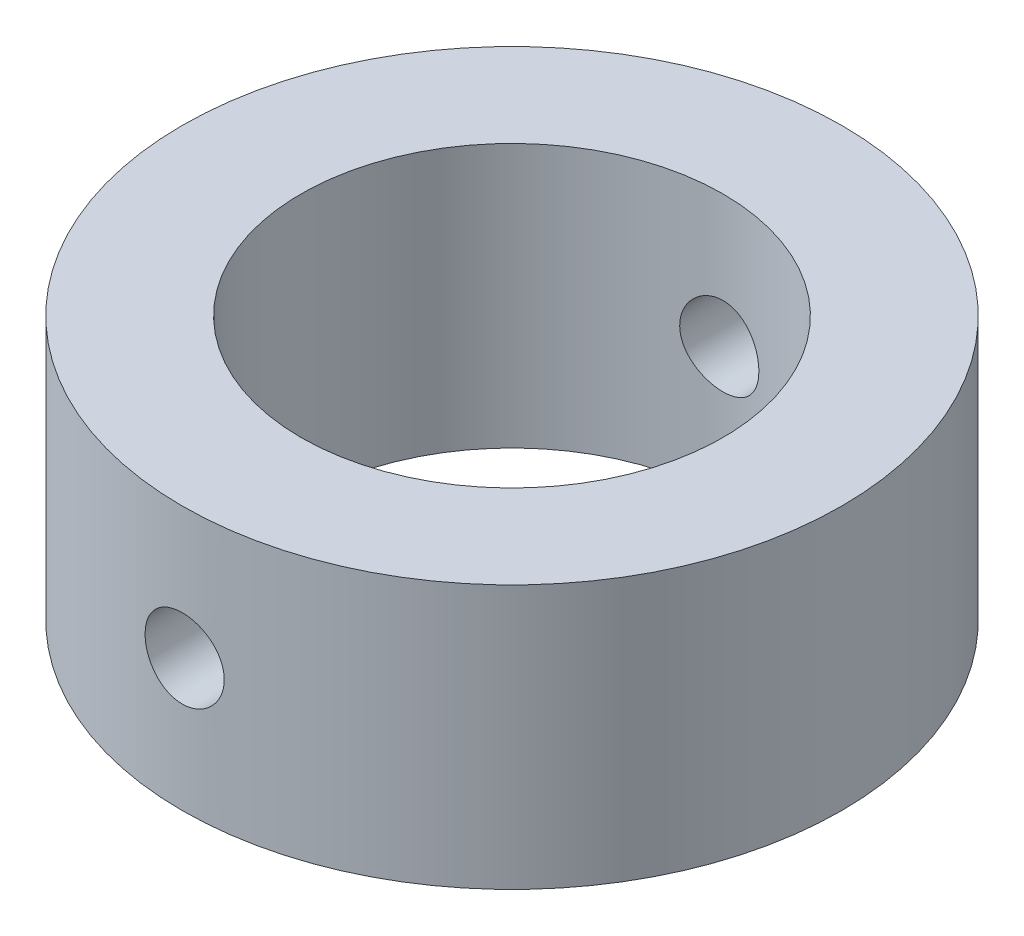
ISO-10303-21;
HEADER;
FILE_DESCRIPTION(('STEP AP214'),'2;1');
FILE_NAME('part.step','',(''),(''),'','','');
FILE_SCHEMA(('AUTOMOTIVE_DESIGN { 1 0 10303 214 1 1 1 1 }'));
ENDSEC;
DATA;
#1=APPLICATION_CONTEXT('core data for automotive mechanical design processes');
#2=APPLICATION_PROTOCOL_DEFINITION('international standard','automotive_design',2000,#1);
#3=PRODUCT_CONTEXT('',#1,'mechanical');
#4=PRODUCT('Part','Part','',(#3));
#5=PRODUCT_RELATED_PRODUCT_CATEGORY('part','',(#4));
#6=PRODUCT_DEFINITION_FORMATION('','',#4);
#7=PRODUCT_DEFINITION_CONTEXT('part definition',#1,'design');
#8=PRODUCT_DEFINITION('design','',#6,#7);
#9=PRODUCT_DEFINITION_SHAPE('','',#8);
#10=(LENGTH_UNIT() NAMED_UNIT(*) SI_UNIT(.MILLI.,.METRE.));
#11=(NAMED_UNIT(*) PLANE_ANGLE_UNIT() SI_UNIT($,.RADIAN.));
#12=(NAMED_UNIT(*) SI_UNIT($,.STERADIAN.) SOLID_ANGLE_UNIT());
#13=UNCERTAINTY_MEASURE_WITH_UNIT(LENGTH_MEASURE(1.E-05),#10,'distance_accuracy_value','');
#14=(GEOMETRIC_REPRESENTATION_CONTEXT(3) GLOBAL_UNCERTAINTY_ASSIGNED_CONTEXT((#13)) GLOBAL_UNIT_ASSIGNED_CONTEXT((#10,
#11,#12)) REPRESENTATION_CONTEXT('',''));
#15=CARTESIAN_POINT('',(0.,0.,0.));
#16=DIRECTION('',(0.,0.,1.));
#17=DIRECTION('',(1.,0.,0.));
#18=AXIS2_PLACEMENT_3D('',#15,#16,#17);
#19=CARTESIAN_POINT('',(7.36079797899167E-07,15.0000028942025,2.4856637945483E-06));
#20=DIRECTION('',(0.,-1.,0.));
#21=DIRECTION('',(0.,0.,-1.));
#22=AXIS2_PLACEMENT_3D('',#19,#20,#21);
#23=CYLINDRICAL_SURFACE('',#22,25.);
#24=CARTESIAN_POINT('',(7.36079797899167E-07,8.00000289420247,-24.9999975143362));
#25=CARTESIAN_POINT('',(-0.167863311027902,7.99999573026103,-24.9999952500821));
#26=CARTESIAN_POINT('',(-0.335833581251394,7.98586623550978,-24.998288934377));
#27=CARTESIAN_POINT('',(-0.667103835228452,7.92972183004708,-24.9916462197582));
#28=CARTESIAN_POINT('',(-0.830398693510271,7.88767745295188,-24.986706407709));
#29=CARTESIAN_POINT('',(-1.14747405926073,7.77695661767645,-24.9741534408788));
#30=CARTESIAN_POINT('',(-1.30126075151245,7.70829768737829,-24.9665420458671));
#31=CARTESIAN_POINT('',(-1.5950984217522,7.54633415911917,-24.9494934407707));
#32=CARTESIAN_POINT('',(-1.73515183105536,7.45303393444915,-24.9400565547503));
#33=CARTESIAN_POINT('',(-1.99829057926471,7.24392803222722,-24.9203576197782));
#34=CARTESIAN_POINT('',(-2.1212959552274,7.12802205409055,-24.9100920174266));
#35=CARTESIAN_POINT('',(-2.34615857430362,6.87720992931457,-24.8899214540514));
#36=CARTESIAN_POINT('',(-2.44801476218494,6.74230283518382,-24.880016511043));
#37=CARTESIAN_POINT('',(-2.62798269265916,6.45680206890408,-24.8616535513767));
#38=CARTESIAN_POINT('',(-2.7060200206459,6.30616116962233,-24.8532001047333));
#39=CARTESIAN_POINT('',(-2.8356598369358,5.99379419209372,-24.8387436488048));
#40=CARTESIAN_POINT('',(-2.88726325088797,5.83206850223316,-24.832740553716));
#41=CARTESIAN_POINT('',(-2.9623285643742,5.50295003489104,-24.8238981217099));
#42=CARTESIAN_POINT('',(-2.98592504379666,5.33558836577479,-24.8210436595905));
#43=CARTESIAN_POINT('',(-3.0047230161169,4.9992579578383,-24.8187752833973));
#44=CARTESIAN_POINT('',(-2.99992556444868,4.8302892789855,-24.8193612414395));
#45=CARTESIAN_POINT('',(-2.96218242470688,4.49647692941812,-24.8238936609668));
#46=CARTESIAN_POINT('',(-2.92938469614323,4.33161625552229,-24.8278224578037));
#47=CARTESIAN_POINT('',(-2.83680272562087,4.0097558663811,-24.838570323097));
#48=CARTESIAN_POINT('',(-2.77701797617835,3.85275629902347,-24.845389445905));
#49=CARTESIAN_POINT('',(-2.63199907091882,3.55061342596335,-24.8611697222838));
#50=CARTESIAN_POINT('',(-2.54670032595945,3.40550141584891,-24.870136300556));
#51=CARTESIAN_POINT('',(-2.3531209956149,3.1315956832867,-24.8891969131263));
#52=CARTESIAN_POINT('',(-2.24483944115177,3.00280264929989,-24.8992909949575));
#53=CARTESIAN_POINT('',(-2.007546819542,2.76433180983808,-24.9195478451999));
#54=CARTESIAN_POINT('',(-1.87840816443236,2.65478092434541,-24.9297106417602));
#55=CARTESIAN_POINT('',(-1.60350722285892,2.45889137320216,-24.9488995941911));
#56=CARTESIAN_POINT('',(-1.45774490300025,2.37255275418332,-24.9579257477783));
#57=CARTESIAN_POINT('',(-1.15363857218305,2.22553960856281,-24.9738294005064));
#58=CARTESIAN_POINT('',(-0.995290842635794,2.16487270087203,-24.9807062616171));
#59=CARTESIAN_POINT('',(-0.670555286193642,2.07102415635156,-24.9915305796452));
#60=CARTESIAN_POINT('',(-0.504167806361826,2.03784133419799,-24.9954781628946));
#61=CARTESIAN_POINT('',(-0.169173660294419,2.00006663870478,-24.9999827643666));
#62=CARTESIAN_POINT('',(-0.000586984352253934,1.99529986180177,-25.0005605237115));
#63=CARTESIAN_POINT('',(0.334982804323058,2.01403147207073,-24.9983162966593));
#64=CARTESIAN_POINT('',(0.501965948407126,2.03752930549782,-24.995494376867));
#65=CARTESIAN_POINT('',(0.829075000008153,2.11197785820556,-24.9867808524048));
#66=CARTESIAN_POINT('',(0.989220082448832,2.16284550725255,-24.9808985381271));
#67=CARTESIAN_POINT('',(1.29870613376626,2.29050359755605,-24.9667230645154));
#68=CARTESIAN_POINT('',(1.44804676200327,2.36729485569255,-24.9584298292121));
#69=CARTESIAN_POINT('',(1.73246791374484,2.54504581010489,-24.9403060302057));
#70=CARTESIAN_POINT('',(1.86747702570731,2.64611903201328,-24.9304683228005));
#71=CARTESIAN_POINT('',(2.11867698760183,2.86940374061064,-24.9103793062781));
#72=CARTESIAN_POINT('',(2.23486715080929,2.99161599835042,-24.9001279820846));
#73=CARTESIAN_POINT('',(2.44574868834133,3.25447850963015,-24.8803034628304));
#74=CARTESIAN_POINT('',(2.54032436839919,3.39522190954632,-24.8707340974669));
#75=CARTESIAN_POINT('',(2.70449388037312,3.69069791927802,-24.8534190136745));
#76=CARTESIAN_POINT('',(2.77408817964054,3.84543026732071,-24.8456732611305));
#77=CARTESIAN_POINT('',(2.88613070276138,4.16411350309716,-24.8329080877864));
#78=CARTESIAN_POINT('',(2.92864493767326,4.32804090606186,-24.8278820418995));
#79=CARTESIAN_POINT('',(2.98553345771496,4.66077186368753,-24.8211060417949));
#80=CARTESIAN_POINT('',(2.99990894134061,4.82957521035979,-24.8193559480468));
#81=CARTESIAN_POINT('',(3.00009107425911,5.16611562383964,-24.8193338409432));
#82=CARTESIAN_POINT('',(2.98607947279331,5.33385261997373,-24.8210397007305));
#83=CARTESIAN_POINT('',(2.93026922280069,5.66456968059663,-24.8276898090787));
#84=CARTESIAN_POINT('',(2.88847056430047,5.82754974337805,-24.8326340588019));
#85=CARTESIAN_POINT('',(2.77832813428525,6.14410743309116,-24.8451971667948));
#86=CARTESIAN_POINT('',(2.70999239178519,6.29768788769795,-24.8528152160174));
#87=CARTESIAN_POINT('',(2.54873356235989,6.59123064127257,-24.8698689682501));
#88=CARTESIAN_POINT('',(2.45581026317425,6.73119282266177,-24.8793046869515));
#89=CARTESIAN_POINT('',(2.24733763255185,6.9944558343113,-24.899003026595));
#90=CARTESIAN_POINT('',(2.1316527753813,7.11764899746874,-24.9092703724709));
#91=CARTESIAN_POINT('',(1.88122166942427,7.34294537376847,-24.9294330111531));
#92=CARTESIAN_POINT('',(1.74647091871581,7.44504359183166,-24.9393282153872));
#93=CARTESIAN_POINT('',(1.46119396073117,7.62555347220133,-24.9576696852686));
#94=CARTESIAN_POINT('',(1.31061397070397,7.70388061992475,-24.9661107359572));
#95=CARTESIAN_POINT('',(0.998423487765109,7.83402665864504,-24.9805393663089));
#96=CARTESIAN_POINT('',(0.836825300441942,7.88587459038285,-24.9865296323977));
#97=CARTESIAN_POINT('',(0.561977837316495,7.94906631454059,-24.9939243469361));
#98=CARTESIAN_POINT('',(0.450467305833285,7.96814037808884,-24.9961907937692));
#99=CARTESIAN_POINT('',(0.225987471773493,7.99361103769343,-24.9992281347566));
#100=CARTESIAN_POINT('',(0.113018178833423,8.00000771745292,-24.9999990387854));
#101=CARTESIAN_POINT('',(7.36079797899167E-07,8.00000289420247,-24.9999975143362));
#102=B_SPLINE_CURVE_WITH_KNOTS('',3,(#24,#25,#26,#27,#28,#29,#30,#31,#32,#33,#34,#35,#36,#37,
#38,#39,#40,#41,#42,#43,#44,#45,#46,#47,#48,#49,#50,#51,#52,#53,#54,#55,#56,#57,#58,#59,#60,#61,
#62,#63,#64,#65,#66,#67,#68,#69,#70,#71,#72,#73,#74,#75,#76,#77,#78,#79,#80,#81,#82,#83,#84,#85,
#86,#87,#88,#89,#90,#91,#92,#93,#94,#95,#96,#97,#98,#99,#100,#101),.UNSPECIFIED.,.T.,.F.,(4,2,2,
2,2,2,2,2,2,2,2,2,2,2,2,2,2,2,2,2,2,2,2,2,2,2,2,2,2,2,2,2,2,2,2,2,2,2,4),(0.,0.50317935095616,
1.00689069408623,1.5102708637556,2.01356175441693,2.51913872195878,3.02474090904884,
3.53190689496397,4.03905511999113,4.54375638343279,5.0484388866848,5.55047092912253,
6.05251241253396,6.55583573710536,7.05918028869262,7.56572944640317,8.07227962172601,
8.57898002694278,9.08565857822619,9.58921522624226,10.0927620090108,10.5947890255775,
11.0968318630167,11.6012692178556,12.1057249760356,12.6128207581672,13.119907053063,
13.6257524826489,14.1315763666154,14.6341719319229,15.1367676776234,15.6392114771388,
16.1416596143121,16.6471952402032,17.1528504352009,17.6602829023946,18.1671576479275,
18.5059342945627,18.8447087043981),.UNSPECIFIED.);
#103=CARTESIAN_POINT('',(7.36079797899167E-07,8.00000289420247,-24.9999975143362));
#104=VERTEX_POINT('',#103);
#105=EDGE_CURVE('E93',#104,#104,#102,.T.);
#106=ORIENTED_EDGE('',*,*,#105,.T.);
#107=EDGE_LOOP('',(#106));
#108=FACE_BOUND('',#107,.T.);
#109=CARTESIAN_POINT('',(3.0000007360798,5.00000289420247,24.8193497776455));
#110=CARTESIAN_POINT('',(2.99999356780694,4.8321437530026,24.8193521032158));
#111=CARTESIAN_POINT('',(2.98586487103804,4.66417837405262,24.821071063127));
#112=CARTESIAN_POINT('',(2.92972392317105,4.33291828214459,24.8277589352753));
#113=CARTESIAN_POINT('',(2.88768218846944,4.16962869851621,24.8327312838769));
#114=CARTESIAN_POINT('',(2.7769690822401,3.85256448869794,24.8453547965709));
#115=CARTESIAN_POINT('',(2.7083153639778,3.69878363306874,24.8530041845025));
#116=CARTESIAN_POINT('',(2.5463641116587,3.40495575209901,24.8701177355299));
#117=CARTESIAN_POINT('',(2.4530709381998,3.26490630263383,24.8795815774294));
#118=CARTESIAN_POINT('',(2.24397217538033,3.00176312259296,24.8993124911563));
#119=CARTESIAN_POINT('',(2.1280647085863,2.87875059985404,24.909583067322));
#120=CARTESIAN_POINT('',(1.87724660042855,2.65387417604038,24.9297386442021));
#121=CARTESIAN_POINT('',(1.74233503113392,2.55201130826062,24.9396236260586));
#122=CARTESIAN_POINT('',(1.45683030454778,2.37203636126624,24.9579298879719));
#123=CARTESIAN_POINT('',(1.30619068992879,2.29399747846284,24.9663466237309));
#124=CARTESIAN_POINT('',(0.993826503352572,2.16435443381772,24.9807296099874));
#125=CARTESIAN_POINT('',(0.832102312165339,2.11274936445473,24.9866959446103));
#126=CARTESIAN_POINT('',(0.502988593064881,2.03768063809902,24.9954812181165));
#127=CARTESIAN_POINT('',(0.335630207123177,2.0140822407567,24.9983152221046));
#128=CARTESIAN_POINT('',(-0.000693760588767737,1.99527929489195,25.0005679222739));
#129=CARTESIAN_POINT('',(-0.169659283588542,2.00007371204424,24.9999867428672));
#130=CARTESIAN_POINT('',(-0.503484931437732,2.03781201605383,24.9954867781904));
#131=CARTESIAN_POINT('',(-0.668361701488416,2.07061099917486,24.9915851740976));
#132=CARTESIAN_POINT('',(-0.99025363401138,2.16320104591846,24.9809021279019));
#133=CARTESIAN_POINT('',(-1.14726865696281,2.22299258838411,24.9741206347104));
#134=CARTESIAN_POINT('',(-1.44943038717958,2.36802562310899,24.9584102761191));
#135=CARTESIAN_POINT('',(-1.59454656119559,2.45333013020889,24.949476104533));
#136=CARTESIAN_POINT('',(-1.86845818411899,2.64692179315862,24.9304605823799));
#137=CARTESIAN_POINT('',(-1.99725294268709,2.75520992061808,24.9203791833234));
#138=CARTESIAN_POINT('',(-2.2357164751507,2.99250724374293,24.9001231601934));
#139=CARTESIAN_POINT('',(-2.34525965270399,3.12164267557596,24.889948348918));
#140=CARTESIAN_POINT('',(-2.54113518217177,3.39653440788197,24.8707150902712));
#141=CARTESIAN_POINT('',(-2.62746747122546,3.54229075336695,24.8616566459233));
#142=CARTESIAN_POINT('',(-2.7744760475067,3.84639538434985,24.8456816911853));
#143=CARTESIAN_POINT('',(-2.83514277549662,4.00474833546038,24.8387659791205));
#144=CARTESIAN_POINT('',(-2.92898936424398,4.32949525370365,24.8278753163249));
#145=CARTESIAN_POINT('',(-2.96217044250571,4.49588886432177,24.8239002353369));
#146=CARTESIAN_POINT('',(-2.99993855104186,4.83088599057916,24.8193644872275));
#147=CARTESIAN_POINT('',(-3.00470210662792,4.9994693300836,24.8187827417272));
#148=CARTESIAN_POINT('',(-2.98596524447623,5.3350316750454,24.8210438157784));
#149=CARTESIAN_POINT('',(-2.96246538083269,5.50201071188985,24.8238865681938));
#150=CARTESIAN_POINT('',(-2.88801718334038,5.82909867780044,24.8326571131616));
#151=CARTESIAN_POINT('',(-2.83715388890958,5.98922724101179,24.8385753458796));
#152=CARTESIAN_POINT('',(-2.70951003184644,6.29868217717843,24.8528222709886));
#153=CARTESIAN_POINT('',(-2.63272862650632,6.44800819870551,24.8611510417552));
#154=CARTESIAN_POINT('',(-2.45499229113631,6.73241918917709,24.8793312169937));
#155=CARTESIAN_POINT('',(-2.35392133533496,6.86743118108377,24.8891898466493));
#156=CARTESIAN_POINT('',(-2.13063944228727,7.11863800721426,24.9092960397007));
#157=CARTESIAN_POINT('',(-2.00842774835641,7.23483216760835,24.9195436170076));
#158=CARTESIAN_POINT('',(-1.74556353658792,7.44572264143739,24.9393375801548));
#159=CARTESIAN_POINT('',(-1.60481776333804,7.54030314071389,24.9488800112668));
#160=CARTESIAN_POINT('',(-1.30933569333078,7.70448110353156,24.9661297287798));
#161=CARTESIAN_POINT('',(-1.15459965956462,7.77407903657691,24.9738370496676));
#162=CARTESIAN_POINT('',(-0.835918508640188,7.88612389907826,24.9865305287152));
#163=CARTESIAN_POINT('',(-0.671997434567384,7.92863841408672,24.9915234559266));
#164=CARTESIAN_POINT('',(-0.339279848911679,7.98552963778462,24.9982536221145));
#165=CARTESIAN_POINT('',(-0.17048353938146,7.9999075108956,24.9999909958205));
#166=CARTESIAN_POINT('',(0.166060742335456,8.00009673831479,25.0000137905284));
#167=CARTESIAN_POINT('',(0.333808640738662,7.9860869308857,24.9983208221882));
#168=CARTESIAN_POINT('',(0.664547960876042,7.93027643929997,24.9917160258713));
#169=CARTESIAN_POINT('',(0.827539384169318,7.88847576425288,24.9868041989497));
#170=CARTESIAN_POINT('',(1.14412029206338,7.77832487907095,24.9743112876111));
#171=CARTESIAN_POINT('',(1.29771254482768,7.70998252974823,24.9667309935726));
#172=CARTESIAN_POINT('',(1.59127614660523,7.5487068246178,24.9497417299861));
#173=CARTESIAN_POINT('',(1.73124738537395,7.45577326979864,24.9403327456391));
#174=CARTESIAN_POINT('',(1.99451022032793,7.24728921219718,24.9206664218668));
#175=CARTESIAN_POINT('',(2.11769600395492,7.13160553888034,24.9104043031858));
#176=CARTESIAN_POINT('',(2.34297804320556,6.8811798570464,24.8902271722101));
#177=CARTESIAN_POINT('',(2.44506928421694,6.74643332968758,24.8803122429138));
#178=CARTESIAN_POINT('',(2.62557148336232,6.46115995804344,24.8619144060897));
#179=CARTESIAN_POINT('',(2.70389671806172,6.31057856597588,24.853436730083));
#180=CARTESIAN_POINT('',(2.8340387942962,5.99838514049842,24.8389347221651));
#181=CARTESIAN_POINT('',(2.88588470033532,5.83678542301693,24.8329077018291));
#182=CARTESIAN_POINT('',(2.94907083681895,5.56194335509088,24.825465209517));
#183=CARTESIAN_POINT('',(2.96814238549985,5.4504401422402,24.8231832166501));
#184=CARTESIAN_POINT('',(2.99360970517433,5.2259749620706,24.8201247229781));
#185=CARTESIAN_POINT('',(3.00000556207439,5.1130130046432,24.8193482119699));
#186=CARTESIAN_POINT('',(3.0000007360798,5.00000289420247,24.8193497776455));
#187=B_SPLINE_CURVE_WITH_KNOTS('',3,(#109,#110,#111,#112,#113,#114,#115,#116,#117,#118,#119,
#120,#121,#122,#123,#124,#125,#126,#127,#128,#129,#130,#131,#132,#133,#134,#135,#136,#137,#138,
#139,#140,#141,#142,#143,#144,#145,#146,#147,#148,#149,#150,#151,#152,#153,#154,#155,#156,#157,
#158,#159,#160,#161,#162,#163,#164,#165,#166,#167,#168,#169,#170,#171,#172,#173,#174,#175,#176,
#177,#178,#179,#180,#181,#182,#183,#184,#185,#186),.UNSPECIFIED.,.T.,.F.,(4,2,2,2,2,2,2,2,2,2,2,
2,2,2,2,2,2,2,2,2,2,2,2,2,2,2,2,2,2,2,2,2,2,2,2,2,2,2,4),(0.,0.503164613232924,1.00686154966524,
1.51022492507114,2.01349927674882,2.51909553323416,3.02471648549883,3.53187561756201,
4.03901733675556,4.54370917218766,5.04838262225285,5.5504604616135,6.05254720809333,
6.55588445357933,7.05924298138499,7.56577244411506,8.0723032786378,8.5790226067925,
9.08571948810825,9.58926554088958,10.0928017219916,10.5947819896887,11.0967785804672,
11.6012225031328,12.105684484956,12.6127892929794,13.119884570345,13.6257094034364,
14.1315133027652,14.6341406188081,15.1367677700954,15.6392461723566,16.1417286411941,
16.6472450412647,17.1528814752089,17.6603206216507,18.1672015841626,18.5059562893408,
18.8447086986815),.UNSPECIFIED.);
#188=CARTESIAN_POINT('',(3.0000007360798,5.00000289420247,24.8193497776455));
#189=VERTEX_POINT('',#188);
#190=EDGE_CURVE('E88',#189,#189,#187,.T.);
#191=ORIENTED_EDGE('',*,*,#190,.T.);
#192=EDGE_LOOP('',(#191));
#193=FACE_BOUND('',#192,.T.);
#194=CARTESIAN_POINT('',(7.36079797899167E-07,15.0000028942025,2.4856637945483E-06));
#195=DIRECTION('',(0.,1.,0.));
#196=DIRECTION('',(0.,0.,1.));
#197=AXIS2_PLACEMENT_3D('',#194,#195,#196);
#198=CIRCLE('',#197,25.);
#199=CARTESIAN_POINT('',(7.36079797899167E-07,15.0000028942025,25.0000024856638));
#200=VERTEX_POINT('',#199);
#201=EDGE_CURVE('E10',#200,#200,#198,.T.);
#202=ORIENTED_EDGE('',*,*,#201,.F.);
#203=EDGE_LOOP('',(#202));
#204=FACE_BOUND('',#203,.T.);
#205=CARTESIAN_POINT('',(7.36079797899167E-07,-4.99999710579753,2.4856637945483E-06));
#206=DIRECTION('',(0.,1.,0.));
#207=DIRECTION('',(0.,0.,1.));
#208=AXIS2_PLACEMENT_3D('',#205,#206,#207);
#209=CIRCLE('',#208,25.);
#210=CARTESIAN_POINT('',(7.36079797899167E-07,-4.99999710579753,25.0000024856638));
#211=VERTEX_POINT('',#210);
#212=EDGE_CURVE('E60',#211,#211,#209,.T.);
#213=ORIENTED_EDGE('',*,*,#212,.T.);
#214=EDGE_LOOP('',(#213));
#215=FACE_BOUND('',#214,.T.);
#216=ADVANCED_FACE('F47',(#108,#193,#204,#215),#23,.T.);
#217=CARTESIAN_POINT('',(7.36079797899167E-07,15.0000028942025,2.4856637945483E-06));
#218=DIRECTION('',(0.,1.,0.));
#219=DIRECTION('',(0.,0.,1.));
#220=AXIS2_PLACEMENT_3D('',#217,#218,#219);
#221=PLANE('',#220);
#222=CARTESIAN_POINT('',(7.36079797899167E-07,15.0000028942025,2.4856637945483E-06));
#223=DIRECTION('',(0.,1.,0.));
#224=DIRECTION('',(0.,0.,1.));
#225=AXIS2_PLACEMENT_3D('',#222,#223,#224);
#226=CIRCLE('',#225,16.);
#227=CARTESIAN_POINT('',(7.36079797899167E-07,15.0000028942025,16.0000024856638));
#228=VERTEX_POINT('',#227);
#229=EDGE_CURVE('E68',#228,#228,#226,.T.);
#230=ORIENTED_EDGE('',*,*,#229,.F.);
#231=EDGE_LOOP('',(#230));
#232=FACE_BOUND('',#231,.T.);
#233=ORIENTED_EDGE('',*,*,#201,.T.);
#234=EDGE_LOOP('',(#233));
#235=FACE_BOUND('',#234,.T.);
#236=ADVANCED_FACE('F105',(#232,#235),#221,.T.);
#237=CARTESIAN_POINT('',(7.36079797899167E-07,-4.99999710579753,2.4856637945483E-06));
#238=DIRECTION('',(0.,1.,0.));
#239=DIRECTION('',(0.,0.,1.));
#240=AXIS2_PLACEMENT_3D('',#237,#238,#239);
#241=PLANE('',#240);
#242=CARTESIAN_POINT('',(7.36079797899167E-07,-4.99999710579753,2.4856637945483E-06));
#243=DIRECTION('',(0.,1.,0.));
#244=DIRECTION('',(0.,0.,1.));
#245=AXIS2_PLACEMENT_3D('',#242,#243,#244);
#246=CIRCLE('',#245,16.);
#247=CARTESIAN_POINT('',(7.36079797899167E-07,-4.99999710579753,16.0000024856638));
#248=VERTEX_POINT('',#247);
#249=EDGE_CURVE('E65',#248,#248,#246,.T.);
#250=ORIENTED_EDGE('',*,*,#249,.T.);
#251=EDGE_LOOP('',(#250));
#252=FACE_BOUND('',#251,.T.);
#253=ORIENTED_EDGE('',*,*,#212,.F.);
#254=EDGE_LOOP('',(#253));
#255=FACE_BOUND('',#254,.T.);
#256=ADVANCED_FACE('F107',(#252,#255),#241,.F.);
#257=CARTESIAN_POINT('',(7.36079797899167E-07,-4.99999710579753,2.4856637945483E-06));
#258=DIRECTION('',(0.,1.,0.));
#259=DIRECTION('',(0.,0.,1.));
#260=AXIS2_PLACEMENT_3D('',#257,#258,#259);
#261=CYLINDRICAL_SURFACE('',#260,16.);
#262=CARTESIAN_POINT('',(7.36079797899167E-07,2.00000289420247,16.0000024856638));
#263=CARTESIAN_POINT('',(0.16694422901074,2.00000927337902,15.9999994623408));
#264=CARTESIAN_POINT('',(0.333970721539995,2.01398504744123,15.9973626840981));
#265=CARTESIAN_POINT('',(0.663316995763394,2.06948288443916,15.9870982034742));
#266=CARTESIAN_POINT('',(0.82563268438425,2.11102819548193,15.9794662890017));
#267=CARTESIAN_POINT('',(1.1407466597834,2.22034829672115,15.960065260973));
#268=CARTESIAN_POINT('',(1.29355339745049,2.28809939910755,15.9482998845934));
#269=CARTESIAN_POINT('',(1.58561668226781,2.4478406480481,15.9219166976595));
#270=CARTESIAN_POINT('',(1.72487432503444,2.5398288324921,15.9072991180296));
#271=CARTESIAN_POINT('',(1.9875681679408,2.74660243020982,15.8766292142739));
#272=CARTESIAN_POINT('',(2.11081864614346,2.86162178354274,15.8605631827908));
#273=CARTESIAN_POINT('',(2.33639285878718,3.11068951237759,15.8289088548368));
#274=CARTESIAN_POINT('',(2.43871508986463,3.24473925374104,15.8133205927543));
#275=CARTESIAN_POINT('',(2.62030070939566,3.52937507093041,15.7842535105639));
#276=CARTESIAN_POINT('',(2.6993751754719,3.68008363483694,15.7707923633874));
#277=CARTESIAN_POINT('',(2.83101122272546,3.99294072455605,15.7476967499035));
#278=CARTESIAN_POINT('',(2.88357509034176,4.1550882624249,15.738061953603));
#279=CARTESIAN_POINT('',(2.9601018061498,4.48423335603129,15.7238478771548));
#280=CARTESIAN_POINT('',(2.98438853992058,4.6511530886094,15.7192113929919));
#281=CARTESIAN_POINT('',(3.00467689798673,4.98675766381896,15.715346428719));
#282=CARTESIAN_POINT('',(3.00068105878728,5.15544234680707,15.716117463639));
#283=CARTESIAN_POINT('',(2.96478032812705,5.48744194473456,15.7229283396988));
#284=CARTESIAN_POINT('',(2.93324373600069,5.65079832280277,15.7288986486105));
#285=CARTESIAN_POINT('',(2.84373672400394,5.96985973376768,15.7453261513571));
#286=CARTESIAN_POINT('',(2.78576518086978,6.12556444122106,15.7557835358541));
#287=CARTESIAN_POINT('',(2.64467367966579,6.42598025220299,15.7800795915156));
#288=CARTESIAN_POINT('',(2.56140500672891,6.57061983536408,15.7939381621311));
#289=CARTESIAN_POINT('',(2.37218811468812,6.84401235128293,15.8234619177222));
#290=CARTESIAN_POINT('',(2.26623759386512,6.97276366963207,15.8391272859742));
#291=CARTESIAN_POINT('',(2.03267884978575,7.21285280554739,15.8708025111071));
#292=CARTESIAN_POINT('',(1.90475560980116,7.32388419910595,15.8868139061444));
#293=CARTESIAN_POINT('',(1.63193681027745,7.52295737555328,15.9171502078302));
#294=CARTESIAN_POINT('',(1.48704108059134,7.61099892794331,15.9314750975687));
#295=CARTESIAN_POINT('',(1.18407071382914,7.7616384019425,15.956853279214));
#296=CARTESIAN_POINT('',(1.02597986497279,7.82420445243826,15.9679024683896));
#297=CARTESIAN_POINT('',(0.701278966877192,7.92180708038678,15.9854525937182));
#298=CARTESIAN_POINT('',(0.534669824635373,7.95684658229318,15.9919540130237));
#299=CARTESIAN_POINT('',(0.200298041886569,7.997974956239,15.9996096985034));
#300=CARTESIAN_POINT('',(0.0325887613480691,8.00448367726192,16.0008415039094));
#301=CARTESIAN_POINT('',(-0.301521760104569,7.98949193510717,15.9980333576284));
#302=CARTESIAN_POINT('',(-0.467923064880972,7.96799284807195,15.9939936649524));
#303=CARTESIAN_POINT('',(-0.793362410356636,7.89794482383573,15.9811447156719));
#304=CARTESIAN_POINT('',(-0.952447786012328,7.84960832912684,15.9723729331444));
#305=CARTESIAN_POINT('',(-1.26025652756947,7.72748748064489,15.9510393299138));
#306=CARTESIAN_POINT('',(-1.40897918911041,7.6537013990709,15.9384772518905));
#307=CARTESIAN_POINT('',(-1.69363260694663,7.48184663788344,15.9107630928171));
#308=CARTESIAN_POINT('',(-1.82940581795045,7.38352141712879,15.895584209155));
#309=CARTESIAN_POINT('',(-2.08267591044929,7.16572661947775,15.864389355458));
#310=CARTESIAN_POINT('',(-2.20017108344194,7.04625506819981,15.8483733073575));
#311=CARTESIAN_POINT('',(-2.41514518136116,6.78765825637961,15.8170519996128));
#312=CARTESIAN_POINT('',(-2.51233758829173,6.64829307795169,15.8017590028689));
#313=CARTESIAN_POINT('',(-2.68193276507594,6.35496764515496,15.7738621972344));
#314=CARTESIAN_POINT('',(-2.75433645619868,6.20100793346152,15.7612582884108));
#315=CARTESIAN_POINT('',(-2.87189273417666,5.88359115971739,15.7402629698553));
#316=CARTESIAN_POINT('',(-2.91717663981593,5.7201841350838,15.7318512944014));
#317=CARTESIAN_POINT('',(-2.97961285044491,5.38790844915966,15.7201465617121));
#318=CARTESIAN_POINT('',(-2.99676832933437,5.21904040626166,15.7168529269796));
#319=CARTESIAN_POINT('',(-3.0023545068873,4.88350623131944,15.7157864817409));
#320=CARTESIAN_POINT('',(-2.99123716399018,4.71684773228848,15.7179268051497));
#321=CARTESIAN_POINT('',(-2.94158277149626,4.38782005011189,15.7272944988638));
#322=CARTESIAN_POINT('',(-2.90304588570684,4.22545084134759,15.7345218387787));
#323=CARTESIAN_POINT('',(-2.79983701558547,3.90985392461151,15.7532126461274));
#324=CARTESIAN_POINT('',(-2.73521397186525,3.75660971151093,15.7646681775631));
#325=CARTESIAN_POINT('',(-2.58171664216429,3.46306638572078,15.7905302367006));
#326=CARTESIAN_POINT('',(-2.49284064288392,3.3227681885129,15.8049369728662));
#327=CARTESIAN_POINT('',(-2.2917890107109,3.05683553411788,15.8353478078187));
#328=CARTESIAN_POINT('',(-2.17928446120627,2.93145206906826,15.8513725927247));
#329=CARTESIAN_POINT('',(-1.93485511740478,2.70119256927342,15.8830591640385));
#330=CARTESIAN_POINT('',(-1.80292586770343,2.59632125224219,15.8987208662104));
#331=CARTESIAN_POINT('',(-1.52196915406395,2.40918098894835,15.9280820050248));
#332=CARTESIAN_POINT('',(-1.37279844520124,2.32712403722119,15.941762505475));
#333=CARTESIAN_POINT('',(-1.06257949122787,2.1893676209922,15.9654348732775));
#334=CARTESIAN_POINT('',(-0.9015425673307,2.13364340010865,15.9754302032445));
#335=CARTESIAN_POINT('',(-0.616693669570511,2.06144826536512,15.9885682998164));
#336=CARTESIAN_POINT('',(-0.494546884423944,2.03844563357686,15.9928319032279));
#337=CARTESIAN_POINT('',(-0.248281758150518,2.00772076996957,15.998550084744));
#338=CARTESIAN_POINT('',(-0.124163467225621,1.99999814969065,16.0000047342599));
#339=CARTESIAN_POINT('',(7.36079797899167E-07,2.00000289420247,16.0000024856638));
#340=B_SPLINE_CURVE_WITH_KNOTS('',3,(#262,#263,#264,#265,#266,#267,#268,#269,#270,#271,#272,
#273,#274,#275,#276,#277,#278,#279,#280,#281,#282,#283,#284,#285,#286,#287,#288,#289,#290,#291,
#292,#293,#294,#295,#296,#297,#298,#299,#300,#301,#302,#303,#304,#305,#306,#307,#308,#309,#310,
#311,#312,#313,#314,#315,#316,#317,#318,#319,#320,#321,#322,#323,#324,#325,#326,#327,#328,#329,
#330,#331,#332,#333,#334,#335,#336,#337,#338,#339),.UNSPECIFIED.,.T.,.F.,(4,2,2,2,2,2,2,2,2,2,2,
2,2,2,2,2,2,2,2,2,2,2,2,2,2,2,2,2,2,2,2,2,2,2,2,2,2,2,4),(0.,0.500376401929849,1.0011752850709,
1.50152254246182,2.00182930673782,2.50750236027261,3.01321172567233,3.52292381008715,
4.03259192623897,4.53636302890672,5.04008895174512,5.53718001225531,6.03429219693573,
6.53438525259061,7.03452908099719,7.54255536928154,8.05058675089895,8.55925176643397,
9.06786273347491,9.56896348152193,10.0700396092917,10.5672046781566,11.0644035067606,
11.5670355603542,12.069714568262,12.579068739746,13.0884039790989,13.5952525563712,
14.1020439389303,14.600785044635,15.0995231708301,15.5973299241538,16.0951718531085,
16.6004673993276,17.1058790252451,17.6158409783263,18.1253225386235,18.4974868904882,
18.8696417807908),.UNSPECIFIED.);
#341=CARTESIAN_POINT('',(7.36079797899167E-07,2.00000289420247,16.0000024856638));
#342=VERTEX_POINT('',#341);
#343=EDGE_CURVE('E51',#342,#342,#340,.T.);
#344=ORIENTED_EDGE('',*,*,#343,.T.);
#345=EDGE_LOOP('',(#344));
#346=FACE_BOUND('',#345,.T.);
#347=CARTESIAN_POINT('',(3.0000007360798,5.00000289420247,-15.7162311598379));
#348=CARTESIAN_POINT('',(2.99999433374568,4.83308847817722,-15.7162343902376));
#349=CARTESIAN_POINT('',(2.98602326305877,4.66609099776521,-15.71891910955));
#350=CARTESIAN_POINT('',(2.93054580111564,4.33680497103912,-15.729354534615));
#351=CARTESIAN_POINT('',(2.88901605144926,4.17452054134764,-15.737109537798));
#352=CARTESIAN_POINT('',(2.77974144843562,3.85947275146059,-15.7567770436362));
#353=CARTESIAN_POINT('',(2.71202101516729,3.70670067558786,-15.7686856724567));
#354=CARTESIAN_POINT('',(2.55235205128709,3.41469577562887,-15.7953140407548));
#355=CARTESIAN_POINT('',(2.46040541126366,3.27546189619587,-15.8100335608485));
#356=CARTESIAN_POINT('',(2.25367431493225,3.01274249580419,-15.8408298111153));
#357=CARTESIAN_POINT('',(2.13864659474163,2.889449927259,-15.8569198468498));
#358=CARTESIAN_POINT('',(1.8895442936869,2.66379411500334,-15.8885266676168));
#359=CARTESIAN_POINT('',(1.75546846332968,2.56143224535288,-15.9040434149592));
#360=CARTESIAN_POINT('',(1.47080852522012,2.37980414100143,-15.9328978709043));
#361=CARTESIAN_POINT('',(1.32010641614753,2.30071982716362,-15.9462180753835));
#362=CARTESIAN_POINT('',(1.00726330258132,2.1690638096554,-15.9690296869948));
#363=CARTESIAN_POINT('',(0.845123239798807,2.11648992622203,-15.9785214089029));
#364=CARTESIAN_POINT('',(0.516006228454628,2.0399437969802,-15.9925126168118));
#365=CARTESIAN_POINT('',(0.34910738256951,2.0156462823571,-15.9970688338627));
#366=CARTESIAN_POINT('',(0.0135440881505623,1.99532911880166,-16.0008712066481));
#367=CARTESIAN_POINT('',(-0.155120208815544,1.99930706192435,-16.0001178145501));
#368=CARTESIAN_POINT('',(-0.487195979718997,2.03517843649677,-15.993430189601));
#369=CARTESIAN_POINT('',(-0.650646784823142,2.06672163306249,-15.9875609592805));
#370=CARTESIAN_POINT('',(-0.969893595351154,2.15627419299294,-15.9713740410074));
#371=CARTESIAN_POINT('',(-1.12568932157328,2.21428452089408,-15.9610561909355));
#372=CARTESIAN_POINT('',(-1.42621939542325,2.35545835631907,-15.937022720283));
#373=CARTESIAN_POINT('',(-1.57088640759727,2.43876187002746,-15.9232882661527));
#374=CARTESIAN_POINT('',(-1.84431921834948,2.62805423235677,-15.8939404651932));
#375=CARTESIAN_POINT('',(-1.97308339774177,2.73404538797763,-15.8783269273595));
#376=CARTESIAN_POINT('',(-2.21313050185828,2.96763430016953,-15.8466677879475));
#377=CARTESIAN_POINT('',(-2.32411507906103,3.09553846200661,-15.8306192323686));
#378=CARTESIAN_POINT('',(-2.52310270094541,3.36830195675972,-15.8001276928286));
#379=CARTESIAN_POINT('',(-2.61110540934384,3.51316153773174,-15.7856847323632));
#380=CARTESIAN_POINT('',(-2.76171630840975,3.81611943560779,-15.7600353804786));
#381=CARTESIAN_POINT('',(-2.82428113682863,3.97423980858375,-15.7488345249414));
#382=CARTESIAN_POINT('',(-2.92187240342132,4.29900526244887,-15.73102236227));
#383=CARTESIAN_POINT('',(-2.95690196194236,4.46564937513203,-15.7244105351086));
#384=CARTESIAN_POINT('',(-2.99799271691498,4.80004155191422,-15.7166279203563));
#385=CARTESIAN_POINT('',(-3.00448254963738,4.96773512533349,-15.7153766306589));
#386=CARTESIAN_POINT('',(-2.98945864155469,5.30180980437676,-15.718241342753));
#387=CARTESIAN_POINT('',(-2.96794628564886,5.46819097449863,-15.7223570791084));
#388=CARTESIAN_POINT('',(-2.89789662783785,5.79350870031124,-15.7354171156003));
#389=CARTESIAN_POINT('',(-2.84958403559999,5.95249539945226,-15.7443212481538));
#390=CARTESIAN_POINT('',(-2.7275437515014,6.26011727366278,-15.7659201974686));
#391=CARTESIAN_POINT('',(-2.6538141864961,6.40875168483313,-15.7786152936018));
#392=CARTESIAN_POINT('',(-2.4820463263134,6.6933381322888,-15.8065490716099));
#393=CARTESIAN_POINT('',(-2.38373725671262,6.82912396993461,-15.8218154228425));
#394=CARTESIAN_POINT('',(-2.16596615080513,7.08242697463113,-15.8530937416982));
#395=CARTESIAN_POINT('',(-2.04650221258187,7.19994249731401,-15.8691057762661));
#396=CARTESIAN_POINT('',(-1.78789809966097,7.41497042127072,-15.9003299944551));
#397=CARTESIAN_POINT('',(-1.64851633211198,7.5121945474144,-15.9155286310023));
#398=CARTESIAN_POINT('',(-1.35514831000048,7.6818453065578,-15.9431856105432));
#399=CARTESIAN_POINT('',(-1.20116261799726,7.75427289425248,-15.9556440590307));
#400=CARTESIAN_POINT('',(-0.883754347077569,7.87184308993063,-15.9763586742531));
#401=CARTESIAN_POINT('',(-0.720385690078178,7.91712726932529,-15.984636608939));
#402=CARTESIAN_POINT('',(-0.38819171868334,7.97957699078224,-15.9961503560111));
#403=CARTESIAN_POINT('',(-0.219366980351896,7.99674549152787,-15.999386698935));
#404=CARTESIAN_POINT('',(0.116182256580812,8.00237349723936,-16.0004420646449));
#405=CARTESIAN_POINT('',(0.282899350212314,7.99126840046156,-15.9983432468362));
#406=CARTESIAN_POINT('',(0.61204747463822,7.94161803866555,-15.9891348465709));
#407=CARTESIAN_POINT('',(0.774478546507261,7.90307303671389,-15.982025312152));
#408=CARTESIAN_POINT('',(1.09021368727068,7.79982047943519,-15.9635942738948));
#409=CARTESIAN_POINT('',(1.24353337471594,7.73515926844103,-15.9522802339591));
#410=CARTESIAN_POINT('',(1.5372119987135,7.58156198689152,-15.9266649557203));
#411=CARTESIAN_POINT('',(1.67757006608749,7.49262428998701,-15.9123635172982));
#412=CARTESIAN_POINT('',(1.94351079163864,7.29149998532001,-15.8820931115022));
#413=CARTESIAN_POINT('',(2.06885320685647,7.17899882648726,-15.8661032060385));
#414=CARTESIAN_POINT('',(2.29903145739389,6.93459376920885,-15.8343901852361));
#415=CARTESIAN_POINT('',(2.4038624625918,6.80268531342438,-15.8186671335315));
#416=CARTESIAN_POINT('',(2.59095341497385,6.52174998482233,-15.78910906239));
#417=CARTESIAN_POINT('',(2.67299554666027,6.37257601497387,-15.7752928582098));
#418=CARTESIAN_POINT('',(2.81072338449131,6.06235131435038,-15.7513392056347));
#419=CARTESIAN_POINT('',(2.86643396884442,5.90131196105174,-15.741198286929));
#420=CARTESIAN_POINT('',(2.93859526801209,5.61649831805473,-15.7278578404634));
#421=CARTESIAN_POINT('',(2.96158285087919,5.49439144667427,-15.7235237287719));
#422=CARTESIAN_POINT('',(2.99228775760172,5.24820595736614,-15.7177092261693));
#423=CARTESIAN_POINT('',(3.00000549712161,5.12412739320312,-15.7162287575784));
#424=CARTESIAN_POINT('',(3.0000007360798,5.00000289420247,-15.7162311598379));
#425=B_SPLINE_CURVE_WITH_KNOTS('',3,(#347,#348,#349,#350,#351,#352,#353,#354,#355,#356,#357,
#358,#359,#360,#361,#362,#363,#364,#365,#366,#367,#368,#369,#370,#371,#372,#373,#374,#375,#376,
#377,#378,#379,#380,#381,#382,#383,#384,#385,#386,#387,#388,#389,#390,#391,#392,#393,#394,#395,
#396,#397,#398,#399,#400,#401,#402,#403,#404,#405,#406,#407,#408,#409,#410,#411,#412,#413,#414,
#415,#416,#417,#418,#419,#420,#421,#422,#423,#424),.UNSPECIFIED.,.T.,.F.,(4,2,2,2,2,2,2,2,2,2,2,
2,2,2,2,2,2,2,2,2,2,2,2,2,2,2,2,2,2,2,2,2,2,2,2,2,2,2,4),(0.,0.500289011586374,1.00100260476079,
1.50125045595687,2.00145927987816,2.50724671397382,3.0130673413863,3.52274208696095,
4.03237491879281,4.53608550920522,5.03975320401296,5.53711301197449,6.03449094656849,
6.53467383968438,7.03490761823571,7.54281229528128,8.050724403848,8.55949872236533,
9.06821537732975,9.5692649717415,10.0702897867744,10.5671758463074,11.0640985324863,
11.5667572530829,12.0694611878935,12.5788825099174,13.0882842164341,13.5950053883737,
14.1016732333466,14.6005860114028,15.0994940064433,15.5975205306072,16.0955804271422,
16.6007692801749,17.1060769546153,17.6160600363782,18.1255603150176,18.4976061505795,
18.8696418584437),.UNSPECIFIED.);
#426=CARTESIAN_POINT('',(3.0000007360798,5.00000289420247,-15.7162311598379));
#427=VERTEX_POINT('',#426);
#428=EDGE_CURVE('E70',#427,#427,#425,.T.);
#429=ORIENTED_EDGE('',*,*,#428,.T.);
#430=EDGE_LOOP('',(#429));
#431=FACE_BOUND('',#430,.T.);
#432=ORIENTED_EDGE('',*,*,#249,.F.);
#433=EDGE_LOOP('',(#432));
#434=FACE_BOUND('',#433,.T.);
#435=ORIENTED_EDGE('',*,*,#229,.T.);
#436=EDGE_LOOP('',(#435));
#437=FACE_BOUND('',#436,.T.);
#438=ADVANCED_FACE('F75',(#346,#431,#434,#437),#261,.F.);
#439=CARTESIAN_POINT('',(7.36079797899167E-07,5.00000289420247,-24.9999975143362));
#440=DIRECTION('',(0.,0.,1.));
#441=DIRECTION('',(1.,0.,0.));
#442=AXIS2_PLACEMENT_3D('',#439,#440,#441);
#443=CYLINDRICAL_SURFACE('',#442,3.);
#444=ORIENTED_EDGE('',*,*,#428,.F.);
#445=EDGE_LOOP('',(#444));
#446=FACE_BOUND('',#445,.T.);
#447=ORIENTED_EDGE('',*,*,#105,.F.);
#448=EDGE_LOOP('',(#447));
#449=FACE_BOUND('',#448,.T.);
#450=ADVANCED_FACE('F78',(#446,#449),#443,.F.);
#451=ORIENTED_EDGE('',*,*,#343,.F.);
#452=EDGE_LOOP('',(#451));
#453=FACE_BOUND('',#452,.T.);
#454=ORIENTED_EDGE('',*,*,#190,.F.);
#455=EDGE_LOOP('',(#454));
#456=FACE_BOUND('',#455,.T.);
#457=ADVANCED_FACE('F81',(#453,#456),#443,.F.);
#458=CLOSED_SHELL('',(#216,#236,#256,#438,#450,#457));
#459=MANIFOLD_SOLID_BREP('B2',#458);
#460=ADVANCED_BREP_SHAPE_REPRESENTATION('',(#18,#459),#14);
#461=SHAPE_DEFINITION_REPRESENTATION(#9,#460);
ENDSEC;
END-ISO-10303-21;
